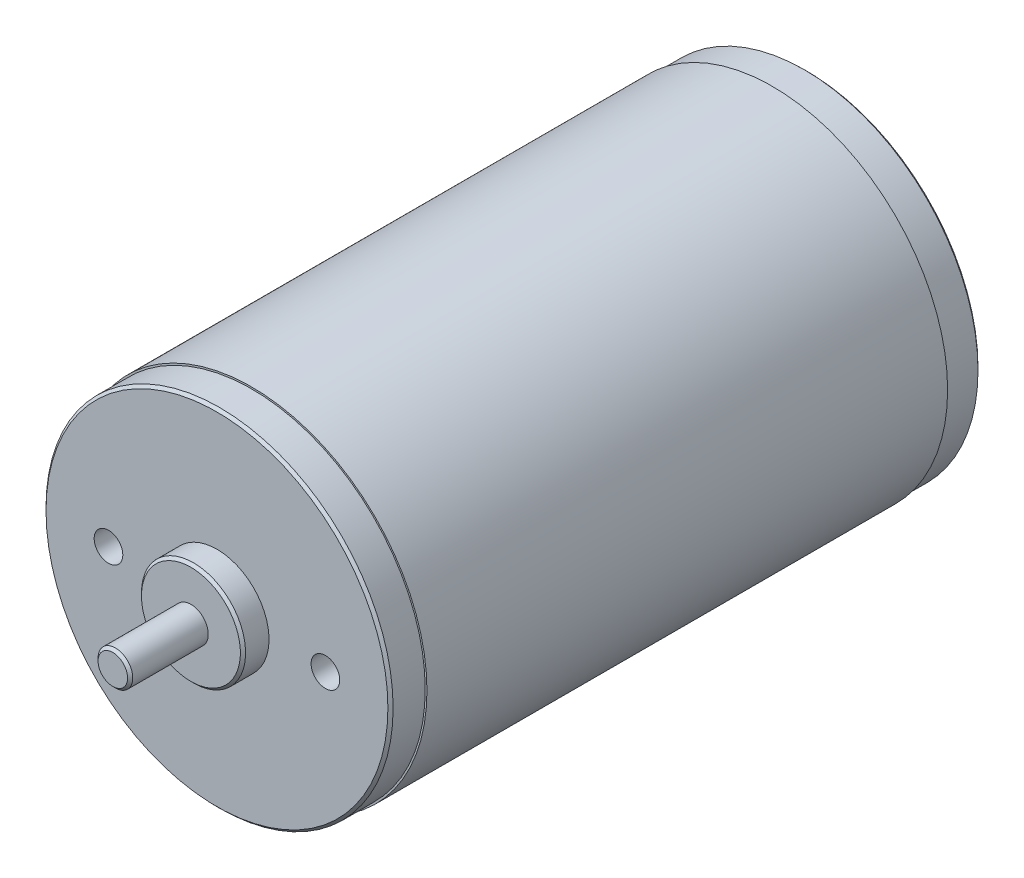
ISO-10303-21;
HEADER;
FILE_DESCRIPTION(('STEP AP214'),'2;1');
FILE_NAME('part.step','',(''),(''),'','','');
FILE_SCHEMA(('AUTOMOTIVE_DESIGN { 1 0 10303 214 1 1 1 1 }'));
ENDSEC;
DATA;
#1=APPLICATION_CONTEXT('core data for automotive mechanical design processes');
#2=APPLICATION_PROTOCOL_DEFINITION('international standard','automotive_design',2000,#1);
#3=PRODUCT_CONTEXT('',#1,'mechanical');
#4=PRODUCT('Part','Part','',(#3));
#5=PRODUCT_RELATED_PRODUCT_CATEGORY('part','',(#4));
#6=PRODUCT_DEFINITION_FORMATION('','',#4);
#7=PRODUCT_DEFINITION_CONTEXT('part definition',#1,'design');
#8=PRODUCT_DEFINITION('design','',#6,#7);
#9=PRODUCT_DEFINITION_SHAPE('','',#8);
#10=(LENGTH_UNIT() NAMED_UNIT(*) SI_UNIT(.MILLI.,.METRE.));
#11=(NAMED_UNIT(*) PLANE_ANGLE_UNIT() SI_UNIT($,.RADIAN.));
#12=(NAMED_UNIT(*) SI_UNIT($,.STERADIAN.) SOLID_ANGLE_UNIT());
#13=UNCERTAINTY_MEASURE_WITH_UNIT(LENGTH_MEASURE(1.E-05),#10,'distance_accuracy_value','');
#14=(GEOMETRIC_REPRESENTATION_CONTEXT(3) GLOBAL_UNCERTAINTY_ASSIGNED_CONTEXT((#13)) GLOBAL_UNIT_ASSIGNED_CONTEXT((#10,
#11,#12)) REPRESENTATION_CONTEXT('',''));
#15=CARTESIAN_POINT('',(0.,0.,0.));
#16=DIRECTION('',(0.,0.,1.));
#17=DIRECTION('',(1.,0.,0.));
#18=AXIS2_PLACEMENT_3D('',#15,#16,#17);
#19=CARTESIAN_POINT('',(0.,0.,12.));
#20=DIRECTION('',(0.,0.,1.));
#21=DIRECTION('',(1.,0.,0.));
#22=AXIS2_PLACEMENT_3D('',#19,#20,#21);
#23=PLANE('',#22);
#24=CARTESIAN_POINT('',(0.,0.,12.0000000000573));
#25=DIRECTION('',(0.,0.,-1.));
#26=DIRECTION('',(-1.,0.,0.));
#27=AXIS2_PLACEMENT_3D('',#24,#25,#26);
#28=CIRCLE('',#27,1.70000000002801);
#29=CARTESIAN_POINT('',(-1.70000000002801,0.,12.0000000000573));
#30=VERTEX_POINT('',#29);
#31=EDGE_CURVE('E19',#30,#30,#28,.T.);
#32=ORIENTED_EDGE('',*,*,#31,.F.);
#33=EDGE_LOOP('',(#32));
#34=FACE_BOUND('',#33,.T.);
#35=ADVANCED_FACE('F16',(#34),#23,.T.);
#36=CARTESIAN_POINT('',(0.,0.,11.7000000000758));
#37=DIRECTION('',(0.,0.,-1.));
#38=DIRECTION('',(-1.,0.,0.));
#39=AXIS2_PLACEMENT_3D('',#36,#37,#38);
#40=CONICAL_SURFACE('',#39,2.00000000000955,0.785398163397448);
#41=CARTESIAN_POINT('',(0.,0.,11.7));
#42=DIRECTION('',(0.,0.,-1.));
#43=DIRECTION('',(-1.,0.,0.));
#44=AXIS2_PLACEMENT_3D('',#41,#42,#43);
#45=CIRCLE('',#44,2.);
#46=CARTESIAN_POINT('',(-2.,0.,11.7));
#47=VERTEX_POINT('',#46);
#48=EDGE_CURVE('E61',#47,#47,#45,.T.);
#49=ORIENTED_EDGE('',*,*,#48,.F.);
#50=EDGE_LOOP('',(#49));
#51=FACE_BOUND('',#50,.T.);
#52=ORIENTED_EDGE('',*,*,#31,.T.);
#53=EDGE_LOOP('',(#52));
#54=FACE_BOUND('',#53,.T.);
#55=ADVANCED_FACE('F119',(#51,#54),#40,.T.);
#56=CARTESIAN_POINT('',(0.,0.,12.));
#57=DIRECTION('',(0.,0.,-1.));
#58=DIRECTION('',(-1.,0.,0.));
#59=AXIS2_PLACEMENT_3D('',#56,#57,#58);
#60=CYLINDRICAL_SURFACE('',#59,2.);
#61=CARTESIAN_POINT('',(0.,0.,3.));
#62=DIRECTION('',(0.,0.,-1.));
#63=DIRECTION('',(-1.,0.,0.));
#64=AXIS2_PLACEMENT_3D('',#61,#62,#63);
#65=CIRCLE('',#64,2.);
#66=CARTESIAN_POINT('',(-2.,0.,3.));
#67=VERTEX_POINT('',#66);
#68=EDGE_CURVE('E64',#67,#67,#65,.T.);
#69=ORIENTED_EDGE('',*,*,#68,.F.);
#70=EDGE_LOOP('',(#69));
#71=FACE_BOUND('',#70,.T.);
#72=ORIENTED_EDGE('',*,*,#48,.T.);
#73=EDGE_LOOP('',(#72));
#74=FACE_BOUND('',#73,.T.);
#75=ADVANCED_FACE('F115',(#71,#74),#60,.T.);
#76=CARTESIAN_POINT('',(0.,0.,-69.5));
#77=DIRECTION('',(0.,0.,-1.));
#78=DIRECTION('',(-1.,0.,0.));
#79=AXIS2_PLACEMENT_3D('',#76,#77,#78);
#80=PLANE('',#79);
#81=CARTESIAN_POINT('',(0.,0.,-69.5000000000618));
#82=DIRECTION('',(0.,0.,1.));
#83=DIRECTION('',(1.,0.,0.));
#84=AXIS2_PLACEMENT_3D('',#81,#82,#83);
#85=CIRCLE('',#84,6.02500000002237);
#86=CARTESIAN_POINT('',(6.02500000002237,0.,-69.5000000000618));
#87=VERTEX_POINT('',#86);
#88=EDGE_CURVE('E105',#87,#87,#85,.T.);
#89=ORIENTED_EDGE('',*,*,#88,.F.);
#90=EDGE_LOOP('',(#89));
#91=FACE_BOUND('',#90,.T.);
#92=ADVANCED_FACE('F118',(#91),#80,.T.);
#93=CARTESIAN_POINT('',(0.,0.,3.));
#94=DIRECTION('',(0.,0.,1.));
#95=DIRECTION('',(1.,0.,0.));
#96=AXIS2_PLACEMENT_3D('',#93,#94,#95);
#97=PLANE('',#96);
#98=ORIENTED_EDGE('',*,*,#68,.T.);
#99=EDGE_LOOP('',(#98));
#100=FACE_BOUND('',#99,.T.);
#101=CARTESIAN_POINT('',(0.,0.,2.9999999999859));
#102=DIRECTION('',(0.,0.,-1.));
#103=DIRECTION('',(-1.,0.,0.));
#104=AXIS2_PLACEMENT_3D('',#101,#102,#103);
#105=CIRCLE('',#104,5.70000000004711);
#106=CARTESIAN_POINT('',(-5.70000000004711,0.,2.9999999999859));
#107=VERTEX_POINT('',#106);
#108=EDGE_CURVE('E57',#107,#107,#105,.T.);
#109=ORIENTED_EDGE('',*,*,#108,.F.);
#110=EDGE_LOOP('',(#109));
#111=FACE_BOUND('',#110,.T.);
#112=ADVANCED_FACE('F112',(#100,#111),#97,.T.);
#113=CARTESIAN_POINT('',(0.,0.,-69.2000000000803));
#114=DIRECTION('',(0.,0.,1.));
#115=DIRECTION('',(1.,0.,0.));
#116=AXIS2_PLACEMENT_3D('',#113,#114,#115);
#117=CONICAL_SURFACE('',#116,6.32500000000391,0.785398163397448);
#118=ORIENTED_EDGE('',*,*,#88,.T.);
#119=EDGE_LOOP('',(#118));
#120=FACE_BOUND('',#119,.T.);
#121=CARTESIAN_POINT('',(0.,0.,-69.2));
#122=DIRECTION('',(0.,0.,1.));
#123=DIRECTION('',(1.,0.,0.));
#124=AXIS2_PLACEMENT_3D('',#121,#122,#123);
#125=CIRCLE('',#124,6.325);
#126=CARTESIAN_POINT('',(6.325,0.,-69.2));
#127=VERTEX_POINT('',#126);
#128=EDGE_CURVE('E47',#127,#127,#125,.T.);
#129=ORIENTED_EDGE('',*,*,#128,.F.);
#130=EDGE_LOOP('',(#129));
#131=FACE_BOUND('',#130,.T.);
#132=ADVANCED_FACE('F39',(#120,#131),#117,.T.);
#133=CARTESIAN_POINT('',(-12.5,0.,-8.10000000012678));
#134=DIRECTION('',(0.,0.,1.));
#135=DIRECTION('',(1.,0.,0.));
#136=AXIS2_PLACEMENT_3D('',#133,#134,#135);
#137=CONICAL_SURFACE('',#136,1.6499999998814,1.02974425849465);
#138=CARTESIAN_POINT('',(-12.5000000002728,0.,-9.09142002154795));
#139=VERTEX_POINT('',#138);
#140=VERTEX_LOOP('',#139);
#141=FACE_BOUND('',#140,.T.);
#142=CARTESIAN_POINT('',(-12.5,0.,-8.1));
#143=DIRECTION('',(0.,0.,1.));
#144=DIRECTION('',(1.,0.,0.));
#145=AXIS2_PLACEMENT_3D('',#142,#143,#144);
#146=CIRCLE('',#145,1.65);
#147=CARTESIAN_POINT('',(-10.85,0.,-8.1));
#148=VERTEX_POINT('',#147);
#149=EDGE_CURVE('E43',#148,#148,#146,.T.);
#150=ORIENTED_EDGE('',*,*,#149,.T.);
#151=EDGE_LOOP('',(#150));
#152=FACE_BOUND('',#151,.T.);
#153=ADVANCED_FACE('F35',(#141,#152),#137,.F.);
#154=CARTESIAN_POINT('',(12.5,0.,-8.10000000012678));
#155=DIRECTION('',(0.,0.,1.));
#156=DIRECTION('',(1.,0.,0.));
#157=AXIS2_PLACEMENT_3D('',#154,#155,#156);
#158=CONICAL_SURFACE('',#157,1.64999999985866,1.02974425848248);
#159=CARTESIAN_POINT('',(12.4999999997328,0.,-9.09142002157637));
#160=VERTEX_POINT('',#159);
#161=VERTEX_LOOP('',#160);
#162=FACE_BOUND('',#161,.T.);
#163=CARTESIAN_POINT('',(12.5,0.,-8.1));
#164=DIRECTION('',(0.,0.,1.));
#165=DIRECTION('',(1.,0.,0.));
#166=AXIS2_PLACEMENT_3D('',#163,#164,#165);
#167=CIRCLE('',#166,1.65);
#168=CARTESIAN_POINT('',(14.15,0.,-8.1));
#169=VERTEX_POINT('',#168);
#170=EDGE_CURVE('E46',#169,#169,#167,.T.);
#171=ORIENTED_EDGE('',*,*,#170,.T.);
#172=EDGE_LOOP('',(#171));
#173=FACE_BOUND('',#172,.T.);
#174=ADVANCED_FACE('F38',(#162,#173),#158,.F.);
#175=CARTESIAN_POINT('',(0.,0.,2.70000000000437));
#176=DIRECTION('',(0.,0.,-1.));
#177=DIRECTION('',(-1.,0.,0.));
#178=AXIS2_PLACEMENT_3D('',#175,#176,#177);
#179=CONICAL_SURFACE('',#178,6.00000000002865,0.785398163397448);
#180=CARTESIAN_POINT('',(0.,0.,2.70000000000002));
#181=DIRECTION('',(0.,0.,-1.));
#182=DIRECTION('',(-1.,0.,0.));
#183=AXIS2_PLACEMENT_3D('',#180,#181,#182);
#184=CIRCLE('',#183,6.);
#185=CARTESIAN_POINT('',(-6.,0.,2.70000000000002));
#186=VERTEX_POINT('',#185);
#187=EDGE_CURVE('E53',#186,#186,#184,.T.);
#188=ORIENTED_EDGE('',*,*,#187,.F.);
#189=EDGE_LOOP('',(#188));
#190=FACE_BOUND('',#189,.T.);
#191=ORIENTED_EDGE('',*,*,#108,.T.);
#192=EDGE_LOOP('',(#191));
#193=FACE_BOUND('',#192,.T.);
#194=ADVANCED_FACE('F241',(#190,#193),#179,.T.);
#195=CARTESIAN_POINT('',(0.,0.,-69.5));
#196=DIRECTION('',(0.,0.,1.));
#197=DIRECTION('',(1.,0.,0.));
#198=AXIS2_PLACEMENT_3D('',#195,#196,#197);
#199=CYLINDRICAL_SURFACE('',#198,6.325);
#200=ORIENTED_EDGE('',*,*,#128,.T.);
#201=EDGE_LOOP('',(#200));
#202=FACE_BOUND('',#201,.T.);
#203=CARTESIAN_POINT('',(0.,0.,-68.));
#204=DIRECTION('',(0.,0.,1.));
#205=DIRECTION('',(1.,0.,0.));
#206=AXIS2_PLACEMENT_3D('',#203,#204,#205);
#207=CIRCLE('',#206,6.325);
#208=CARTESIAN_POINT('',(6.325,0.,-68.));
#209=VERTEX_POINT('',#208);
#210=EDGE_CURVE('E98',#209,#209,#207,.F.);
#211=ORIENTED_EDGE('',*,*,#210,.T.);
#212=EDGE_LOOP('',(#211));
#213=FACE_BOUND('',#212,.T.);
#214=ADVANCED_FACE('F248',(#202,#213),#199,.T.);
#215=CARTESIAN_POINT('',(-12.5,0.,0.));
#216=DIRECTION('',(0.,0.,1.));
#217=DIRECTION('',(1.,0.,0.));
#218=AXIS2_PLACEMENT_3D('',#215,#216,#217);
#219=CYLINDRICAL_SURFACE('',#218,1.65);
#220=CARTESIAN_POINT('',(-12.5,0.,0.));
#221=DIRECTION('',(0.,0.,1.));
#222=DIRECTION('',(1.,0.,0.));
#223=AXIS2_PLACEMENT_3D('',#220,#221,#222);
#224=CIRCLE('',#223,1.65);
#225=CARTESIAN_POINT('',(-10.85,0.,0.));
#226=VERTEX_POINT('',#225);
#227=EDGE_CURVE('E95',#226,#226,#224,.F.);
#228=ORIENTED_EDGE('',*,*,#227,.F.);
#229=EDGE_LOOP('',(#228));
#230=FACE_BOUND('',#229,.T.);
#231=ORIENTED_EDGE('',*,*,#149,.F.);
#232=EDGE_LOOP('',(#231));
#233=FACE_BOUND('',#232,.T.);
#234=ADVANCED_FACE('F256',(#230,#233),#219,.F.);
#235=CARTESIAN_POINT('',(12.5,0.,0.));
#236=DIRECTION('',(0.,0.,1.));
#237=DIRECTION('',(1.,0.,0.));
#238=AXIS2_PLACEMENT_3D('',#235,#236,#237);
#239=CYLINDRICAL_SURFACE('',#238,1.65);
#240=CARTESIAN_POINT('',(12.5,0.,0.));
#241=DIRECTION('',(0.,0.,1.));
#242=DIRECTION('',(1.,0.,0.));
#243=AXIS2_PLACEMENT_3D('',#240,#241,#242);
#244=CIRCLE('',#243,1.65);
#245=CARTESIAN_POINT('',(14.15,0.,0.));
#246=VERTEX_POINT('',#245);
#247=EDGE_CURVE('E91',#246,#246,#244,.F.);
#248=ORIENTED_EDGE('',*,*,#247,.F.);
#249=EDGE_LOOP('',(#248));
#250=FACE_BOUND('',#249,.T.);
#251=ORIENTED_EDGE('',*,*,#170,.F.);
#252=EDGE_LOOP('',(#251));
#253=FACE_BOUND('',#252,.T.);
#254=ADVANCED_FACE('F264',(#250,#253),#239,.F.);
#255=CARTESIAN_POINT('',(0.,0.,3.));
#256=DIRECTION('',(0.,0.,-1.));
#257=DIRECTION('',(-1.,0.,0.));
#258=AXIS2_PLACEMENT_3D('',#255,#256,#257);
#259=CYLINDRICAL_SURFACE('',#258,6.);
#260=CARTESIAN_POINT('',(0.,0.,0.));
#261=DIRECTION('',(0.,0.,-1.));
#262=DIRECTION('',(-1.,0.,0.));
#263=AXIS2_PLACEMENT_3D('',#260,#261,#262);
#264=CIRCLE('',#263,6.);
#265=CARTESIAN_POINT('',(-6.,0.,0.));
#266=VERTEX_POINT('',#265);
#267=EDGE_CURVE('E87',#266,#266,#264,.T.);
#268=ORIENTED_EDGE('',*,*,#267,.F.);
#269=EDGE_LOOP('',(#268));
#270=FACE_BOUND('',#269,.T.);
#271=ORIENTED_EDGE('',*,*,#187,.T.);
#272=EDGE_LOOP('',(#271));
#273=FACE_BOUND('',#272,.T.);
#274=ADVANCED_FACE('F272',(#270,#273),#259,.T.);
#275=CARTESIAN_POINT('',(0.,0.,-68.));
#276=DIRECTION('',(0.,0.,1.));
#277=DIRECTION('',(1.,0.,0.));
#278=AXIS2_PLACEMENT_3D('',#275,#276,#277);
#279=PLANE('',#278);
#280=ORIENTED_EDGE('',*,*,#210,.F.);
#281=EDGE_LOOP('',(#280));
#282=FACE_BOUND('',#281,.T.);
#283=CARTESIAN_POINT('',(0.,0.,-68.));
#284=DIRECTION('',(0.,0.,1.));
#285=DIRECTION('',(1.,0.,0.));
#286=AXIS2_PLACEMENT_3D('',#283,#284,#285);
#287=CIRCLE('',#286,19.7);
#288=CARTESIAN_POINT('',(19.7,0.,-68.));
#289=VERTEX_POINT('',#288);
#290=EDGE_CURVE('E83',#289,#289,#287,.T.);
#291=ORIENTED_EDGE('',*,*,#290,.F.);
#292=EDGE_LOOP('',(#291));
#293=FACE_BOUND('',#292,.T.);
#294=ADVANCED_FACE('F187',(#282,#293),#279,.F.);
#295=CARTESIAN_POINT('',(0.,0.,0.));
#296=DIRECTION('',(0.,0.,1.));
#297=DIRECTION('',(1.,0.,0.));
#298=AXIS2_PLACEMENT_3D('',#295,#296,#297);
#299=PLANE('',#298);
#300=ORIENTED_EDGE('',*,*,#267,.T.);
#301=EDGE_LOOP('',(#300));
#302=FACE_BOUND('',#301,.T.);
#303=ORIENTED_EDGE('',*,*,#247,.T.);
#304=EDGE_LOOP('',(#303));
#305=FACE_BOUND('',#304,.T.);
#306=ORIENTED_EDGE('',*,*,#227,.T.);
#307=EDGE_LOOP('',(#306));
#308=FACE_BOUND('',#307,.T.);
#309=CARTESIAN_POINT('',(0.,0.,0.));
#310=DIRECTION('',(0.,0.,-1.));
#311=DIRECTION('',(-1.,0.,0.));
#312=AXIS2_PLACEMENT_3D('',#309,#310,#311);
#313=CIRCLE('',#312,19.7);
#314=CARTESIAN_POINT('',(-19.7,0.,0.));
#315=VERTEX_POINT('',#314);
#316=EDGE_CURVE('E78',#315,#315,#313,.T.);
#317=ORIENTED_EDGE('',*,*,#316,.F.);
#318=EDGE_LOOP('',(#317));
#319=FACE_BOUND('',#318,.T.);
#320=ADVANCED_FACE('F156',(#302,#305,#308,#319),#299,.T.);
#321=CARTESIAN_POINT('',(0.,0.,-67.7));
#322=DIRECTION('',(0.,0.,1.));
#323=DIRECTION('',(1.,0.,0.));
#324=AXIS2_PLACEMENT_3D('',#321,#322,#323);
#325=CONICAL_SURFACE('',#324,20.,0.785398163397466);
#326=ORIENTED_EDGE('',*,*,#290,.T.);
#327=EDGE_LOOP('',(#326));
#328=FACE_BOUND('',#327,.T.);
#329=CARTESIAN_POINT('',(0.,0.,-67.7));
#330=DIRECTION('',(0.,0.,-1.));
#331=DIRECTION('',(-1.,0.,0.));
#332=AXIS2_PLACEMENT_3D('',#329,#330,#331);
#333=CIRCLE('',#332,20.);
#334=CARTESIAN_POINT('',(-20.,0.,-67.7));
#335=VERTEX_POINT('',#334);
#336=EDGE_CURVE('E82',#335,#335,#333,.F.);
#337=ORIENTED_EDGE('',*,*,#336,.F.);
#338=EDGE_LOOP('',(#337));
#339=FACE_BOUND('',#338,.T.);
#340=ADVANCED_FACE('F146',(#328,#339),#325,.T.);
#341=CARTESIAN_POINT('',(0.,0.,-0.299999999999963));
#342=DIRECTION('',(0.,0.,-1.));
#343=DIRECTION('',(-1.,0.,0.));
#344=AXIS2_PLACEMENT_3D('',#341,#342,#343);
#345=CONICAL_SURFACE('',#344,20.,0.785398163397472);
#346=ORIENTED_EDGE('',*,*,#316,.T.);
#347=EDGE_LOOP('',(#346));
#348=FACE_BOUND('',#347,.T.);
#349=CARTESIAN_POINT('',(0.,0.,-0.299999999999964));
#350=DIRECTION('',(0.,0.,1.));
#351=DIRECTION('',(1.,0.,0.));
#352=AXIS2_PLACEMENT_3D('',#349,#350,#351);
#353=CIRCLE('',#352,20.);
#354=CARTESIAN_POINT('',(20.,0.,-0.299999999999964));
#355=VERTEX_POINT('',#354);
#356=EDGE_CURVE('E77',#355,#355,#353,.F.);
#357=ORIENTED_EDGE('',*,*,#356,.F.);
#358=EDGE_LOOP('',(#357));
#359=FACE_BOUND('',#358,.T.);
#360=ADVANCED_FACE('F143',(#348,#359),#345,.T.);
#361=CARTESIAN_POINT('',(0.,0.,-64.));
#362=DIRECTION('',(0.,0.,-1.));
#363=DIRECTION('',(-1.,0.,0.));
#364=AXIS2_PLACEMENT_3D('',#361,#362,#363);
#365=CYLINDRICAL_SURFACE('',#364,20.);
#366=CARTESIAN_POINT('',(0.,0.,-64.));
#367=DIRECTION('',(0.,0.,-1.));
#368=DIRECTION('',(-1.,0.,0.));
#369=AXIS2_PLACEMENT_3D('',#366,#367,#368);
#370=CIRCLE('',#369,20.);
#371=CARTESIAN_POINT('',(-20.,0.,-64.));
#372=VERTEX_POINT('',#371);
#373=EDGE_CURVE('E73',#372,#372,#370,.F.);
#374=ORIENTED_EDGE('',*,*,#373,.F.);
#375=EDGE_LOOP('',(#374));
#376=FACE_BOUND('',#375,.T.);
#377=ORIENTED_EDGE('',*,*,#336,.T.);
#378=EDGE_LOOP('',(#377));
#379=FACE_BOUND('',#378,.T.);
#380=ADVANCED_FACE('F145',(#376,#379),#365,.T.);
#381=CARTESIAN_POINT('',(0.,0.,-4.));
#382=DIRECTION('',(0.,0.,1.));
#383=DIRECTION('',(1.,0.,0.));
#384=AXIS2_PLACEMENT_3D('',#381,#382,#383);
#385=CYLINDRICAL_SURFACE('',#384,20.);
#386=CARTESIAN_POINT('',(0.,0.,-4.));
#387=DIRECTION('',(0.,0.,1.));
#388=DIRECTION('',(1.,0.,0.));
#389=AXIS2_PLACEMENT_3D('',#386,#387,#388);
#390=CIRCLE('',#389,20.);
#391=CARTESIAN_POINT('',(20.,0.,-4.));
#392=VERTEX_POINT('',#391);
#393=EDGE_CURVE('E69',#392,#392,#390,.F.);
#394=ORIENTED_EDGE('',*,*,#393,.F.);
#395=EDGE_LOOP('',(#394));
#396=FACE_BOUND('',#395,.T.);
#397=ORIENTED_EDGE('',*,*,#356,.T.);
#398=EDGE_LOOP('',(#397));
#399=FACE_BOUND('',#398,.T.);
#400=ADVANCED_FACE('F141',(#396,#399),#385,.T.);
#401=CARTESIAN_POINT('',(0.,0.,-64.));
#402=DIRECTION('',(0.,0.,-1.));
#403=DIRECTION('',(-1.,0.,0.));
#404=AXIS2_PLACEMENT_3D('',#401,#402,#403);
#405=PLANE('',#404);
#406=CARTESIAN_POINT('',(0.,0.,-64.));
#407=DIRECTION('',(0.,0.,1.));
#408=DIRECTION('',(1.,0.,0.));
#409=AXIS2_PLACEMENT_3D('',#406,#407,#408);
#410=CIRCLE('',#409,20.2);
#411=CARTESIAN_POINT('',(20.2,0.,-64.));
#412=VERTEX_POINT('',#411);
#413=EDGE_CURVE('E26',#412,#412,#410,.T.);
#414=ORIENTED_EDGE('',*,*,#413,.F.);
#415=EDGE_LOOP('',(#414));
#416=FACE_BOUND('',#415,.T.);
#417=ORIENTED_EDGE('',*,*,#373,.T.);
#418=EDGE_LOOP('',(#417));
#419=FACE_BOUND('',#418,.T.);
#420=ADVANCED_FACE('F169',(#416,#419),#405,.T.);
#421=CARTESIAN_POINT('',(0.,0.,-4.));
#422=DIRECTION('',(0.,0.,1.));
#423=DIRECTION('',(1.,0.,0.));
#424=AXIS2_PLACEMENT_3D('',#421,#422,#423);
#425=PLANE('',#424);
#426=CARTESIAN_POINT('',(0.,0.,-4.));
#427=DIRECTION('',(0.,0.,1.));
#428=DIRECTION('',(1.,0.,0.));
#429=AXIS2_PLACEMENT_3D('',#426,#427,#428);
#430=CIRCLE('',#429,20.2);
#431=CARTESIAN_POINT('',(20.2,0.,-4.));
#432=VERTEX_POINT('',#431);
#433=EDGE_CURVE('E11',#432,#432,#430,.F.);
#434=ORIENTED_EDGE('',*,*,#433,.F.);
#435=EDGE_LOOP('',(#434));
#436=FACE_BOUND('',#435,.T.);
#437=ORIENTED_EDGE('',*,*,#393,.T.);
#438=EDGE_LOOP('',(#437));
#439=FACE_BOUND('',#438,.T.);
#440=ADVANCED_FACE('F161',(#436,#439),#425,.T.);
#441=CARTESIAN_POINT('',(0.,0.,-68.));
#442=DIRECTION('',(0.,0.,1.));
#443=DIRECTION('',(1.,0.,0.));
#444=AXIS2_PLACEMENT_3D('',#441,#442,#443);
#445=CYLINDRICAL_SURFACE('',#444,20.2);
#446=ORIENTED_EDGE('',*,*,#433,.T.);
#447=EDGE_LOOP('',(#446));
#448=FACE_BOUND('',#447,.T.);
#449=ORIENTED_EDGE('',*,*,#413,.T.);
#450=EDGE_LOOP('',(#449));
#451=FACE_BOUND('',#450,.T.);
#452=ADVANCED_FACE('F159',(#448,#451),#445,.T.);
#453=CLOSED_SHELL('',(#35,#55,#75,#92,#112,#132,#153,#174,#194,#214,#234,#254,#274,#294,#320,
#340,#360,#380,#400,#420,#440,#452));
#454=MANIFOLD_SOLID_BREP('B1',#453);
#455=ADVANCED_BREP_SHAPE_REPRESENTATION('',(#18,#454),#14);
#456=SHAPE_DEFINITION_REPRESENTATION(#9,#455);
ENDSEC;
END-ISO-10303-21;
